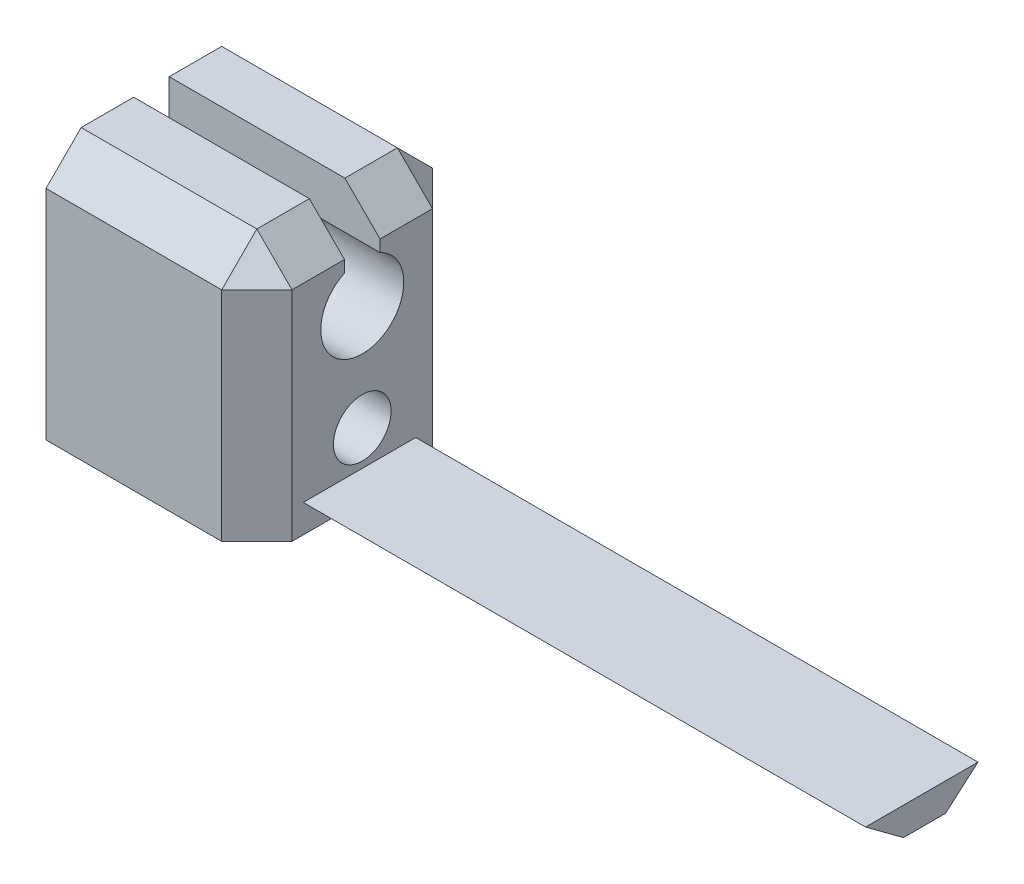
ISO-10303-21;
HEADER;
FILE_DESCRIPTION(('STEP AP214'),'2;1');
FILE_NAME('part.step','',(''),(''),'','','');
FILE_SCHEMA(('AUTOMOTIVE_DESIGN { 1 0 10303 214 1 1 1 1 }'));
ENDSEC;
DATA;
#1=APPLICATION_CONTEXT('core data for automotive mechanical design processes');
#2=APPLICATION_PROTOCOL_DEFINITION('international standard','automotive_design',2000,#1);
#3=PRODUCT_CONTEXT('',#1,'mechanical');
#4=PRODUCT('Part','Part','',(#3));
#5=PRODUCT_RELATED_PRODUCT_CATEGORY('part','',(#4));
#6=PRODUCT_DEFINITION_FORMATION('','',#4);
#7=PRODUCT_DEFINITION_CONTEXT('part definition',#1,'design');
#8=PRODUCT_DEFINITION('design','',#6,#7);
#9=PRODUCT_DEFINITION_SHAPE('','',#8);
#10=(LENGTH_UNIT() NAMED_UNIT(*) SI_UNIT(.MILLI.,.METRE.));
#11=(NAMED_UNIT(*) PLANE_ANGLE_UNIT() SI_UNIT($,.RADIAN.));
#12=(NAMED_UNIT(*) SI_UNIT($,.STERADIAN.) SOLID_ANGLE_UNIT());
#13=UNCERTAINTY_MEASURE_WITH_UNIT(LENGTH_MEASURE(1.E-05),#10,'distance_accuracy_value','');
#14=(GEOMETRIC_REPRESENTATION_CONTEXT(3) GLOBAL_UNCERTAINTY_ASSIGNED_CONTEXT((#13)) GLOBAL_UNIT_ASSIGNED_CONTEXT((#10,
#11,#12)) REPRESENTATION_CONTEXT('',''));
#15=CARTESIAN_POINT('',(0.,0.,0.));
#16=DIRECTION('',(0.,0.,1.));
#17=DIRECTION('',(1.,0.,0.));
#18=AXIS2_PLACEMENT_3D('',#15,#16,#17);
#19=CARTESIAN_POINT('',(0.,36.,0.));
#20=DIRECTION('',(0.,-1.,0.));
#21=DIRECTION('',(0.,0.,-1.));
#22=AXIS2_PLACEMENT_3D('',#19,#20,#21);
#23=PLANE('',#22);
#24=DIRECTION('',(1.,0.,0.));
#25=VECTOR('',#24,1.);
#26=CARTESIAN_POINT('',(0.,36.,10.));
#27=LINE('',#26,#25);
#28=CARTESIAN_POINT('',(-15.,36.,10.));
#29=VERTEX_POINT('',#28);
#30=CARTESIAN_POINT('',(10.,36.,10.));
#31=VERTEX_POINT('',#30);
#32=EDGE_CURVE('E91',#29,#31,#27,.T.);
#33=ORIENTED_EDGE('',*,*,#32,.T.);
#34=DIRECTION('',(0.,0.,-1.));
#35=VECTOR('',#34,1.);
#36=CARTESIAN_POINT('',(10.,36.,0.));
#37=LINE('',#36,#35);
#38=CARTESIAN_POINT('',(10.,36.,2.52855443460033));
#39=VERTEX_POINT('',#38);
#40=EDGE_CURVE('E83',#31,#39,#37,.T.);
#41=ORIENTED_EDGE('',*,*,#40,.T.);
#42=DIRECTION('',(1.,0.,0.));
#43=VECTOR('',#42,1.);
#44=CARTESIAN_POINT('',(0.,36.,2.52855443460033));
#45=LINE('',#44,#43);
#46=CARTESIAN_POINT('',(-15.,36.,2.52855443460033));
#47=VERTEX_POINT('',#46);
#48=EDGE_CURVE('E277',#47,#39,#45,.T.);
#49=ORIENTED_EDGE('',*,*,#48,.F.);
#50=DIRECTION('',(0.,0.,1.));
#51=VECTOR('',#50,1.);
#52=CARTESIAN_POINT('',(-15.,36.,15.));
#53=LINE('',#52,#51);
#54=EDGE_CURVE('E262',#47,#29,#53,.T.);
#55=ORIENTED_EDGE('',*,*,#54,.T.);
#56=EDGE_LOOP('',(#33,#41,#49,#55));
#57=FACE_BOUND('',#56,.T.);
#58=ADVANCED_FACE('F73',(#57),#23,.F.);
#59=CARTESIAN_POINT('',(15.,36.,15.));
#60=DIRECTION('',(-1.,0.,0.));
#61=DIRECTION('',(0.,0.,1.));
#62=AXIS2_PLACEMENT_3D('',#59,#60,#61);
#63=PLANE('',#62);
#64=CARTESIAN_POINT('',(15.,9.,0.));
#65=DIRECTION('',(1.,0.,0.));
#66=DIRECTION('',(0.,0.,-1.));
#67=AXIS2_PLACEMENT_3D('',#64,#65,#66);
#68=CIRCLE('',#67,4.1);
#69=CARTESIAN_POINT('',(15.,9.,-4.1));
#70=VERTEX_POINT('',#69);
#71=EDGE_CURVE('E220',#70,#70,#68,.T.);
#72=ORIENTED_EDGE('',*,*,#71,.F.);
#73=EDGE_LOOP('',(#72));
#74=FACE_BOUND('',#73,.T.);
#75=DIRECTION('',(0.,0.,-1.));
#76=VECTOR('',#75,1.);
#77=CARTESIAN_POINT('',(15.,0.,15.));
#78=LINE('',#77,#76);
#79=CARTESIAN_POINT('',(15.,0.,-2.99999999999999));
#80=VERTEX_POINT('',#79);
#81=CARTESIAN_POINT('',(15.,0.,-9.99999999999999));
#82=VERTEX_POINT('',#81);
#83=EDGE_CURVE('E258',#80,#82,#78,.T.);
#84=ORIENTED_EDGE('',*,*,#83,.T.);
#85=DIRECTION('',(0.,1.,0.));
#86=VECTOR('',#85,1.);
#87=CARTESIAN_POINT('',(15.,36.,-9.99999999999999));
#88=LINE('',#87,#86);
#89=CARTESIAN_POINT('',(15.,31.,-9.99999999999999));
#90=VERTEX_POINT('',#89);
#91=EDGE_CURVE('E301',#82,#90,#88,.T.);
#92=ORIENTED_EDGE('',*,*,#91,.T.);
#93=DIRECTION('',(0.,0.,1.));
#94=VECTOR('',#93,1.);
#95=CARTESIAN_POINT('',(15.,31.,15.));
#96=LINE('',#95,#94);
#97=CARTESIAN_POINT('',(15.,31.,-2.52855443460033));
#98=VERTEX_POINT('',#97);
#99=EDGE_CURVE('E299',#90,#98,#96,.T.);
#100=ORIENTED_EDGE('',*,*,#99,.T.);
#101=DIRECTION('',(0.,-1.,0.));
#102=VECTOR('',#101,1.);
#103=CARTESIAN_POINT('',(15.,36.,-2.52855443460033));
#104=LINE('',#103,#102);
#105=CARTESIAN_POINT('',(15.,29.3307046880561,-2.52855443460033));
#106=VERTEX_POINT('',#105);
#107=EDGE_CURVE('E219',#98,#106,#104,.T.);
#108=ORIENTED_EDGE('',*,*,#107,.T.);
#109=CARTESIAN_POINT('',(15.,24.,0.));
#110=DIRECTION('',(-1.,0.,0.));
#111=DIRECTION('',(0.,0.,1.));
#112=AXIS2_PLACEMENT_3D('',#109,#110,#111);
#113=CIRCLE('',#112,5.9);
#114=CARTESIAN_POINT('',(15.,29.3307046880561,2.52855443460033));
#115=VERTEX_POINT('',#114);
#116=EDGE_CURVE('E209',#115,#106,#113,.F.);
#117=ORIENTED_EDGE('',*,*,#116,.F.);
#118=DIRECTION('',(0.,-1.,0.));
#119=VECTOR('',#118,1.);
#120=CARTESIAN_POINT('',(15.,36.,2.52855443460033));
#121=LINE('',#120,#119);
#122=CARTESIAN_POINT('',(15.,31.,2.52855443460033));
#123=VERTEX_POINT('',#122);
#124=EDGE_CURVE('E193',#123,#115,#121,.T.);
#125=ORIENTED_EDGE('',*,*,#124,.F.);
#126=DIRECTION('',(0.,0.,1.));
#127=VECTOR('',#126,1.);
#128=CARTESIAN_POINT('',(15.,31.,15.));
#129=LINE('',#128,#127);
#130=CARTESIAN_POINT('',(15.,31.,10.));
#131=VERTEX_POINT('',#130);
#132=EDGE_CURVE('E294',#123,#131,#129,.T.);
#133=ORIENTED_EDGE('',*,*,#132,.T.);
#134=DIRECTION('',(0.,-1.,0.));
#135=VECTOR('',#134,1.);
#136=CARTESIAN_POINT('',(15.,36.,10.));
#137=LINE('',#136,#135);
#138=CARTESIAN_POINT('',(15.,0.,10.));
#139=VERTEX_POINT('',#138);
#140=EDGE_CURVE('E296',#131,#139,#137,.T.);
#141=ORIENTED_EDGE('',*,*,#140,.T.);
#142=CARTESIAN_POINT('',(15.,0.,3.00000000000001));
#143=VERTEX_POINT('',#142);
#144=EDGE_CURVE('E263',#139,#143,#78,.T.);
#145=ORIENTED_EDGE('',*,*,#144,.T.);
#146=DIRECTION('',(0.,0.595766049477653,0.803158025727062));
#147=VECTOR('',#146,1.);
#148=CARTESIAN_POINT('',(15.,-1.43548285228105,1.06481155713063));
#149=LINE('',#148,#147);
#150=CARTESIAN_POINT('',(15.,4.,8.39243903831877));
#151=VERTEX_POINT('',#150);
#152=EDGE_CURVE('E232',#143,#151,#149,.T.);
#153=ORIENTED_EDGE('',*,*,#152,.T.);
#154=DIRECTION('',(0.,0.,-1.));
#155=VECTOR('',#154,1.);
#156=CARTESIAN_POINT('',(15.,4.,0.));
#157=LINE('',#156,#155);
#158=CARTESIAN_POINT('',(15.,4.,-7.60756096168123));
#159=VERTEX_POINT('',#158);
#160=EDGE_CURVE('E244',#151,#159,#157,.T.);
#161=ORIENTED_EDGE('',*,*,#160,.T.);
#162=DIRECTION('',(0.,0.65556491281918,-0.755138825038404));
#163=VECTOR('',#162,1.);
#164=CARTESIAN_POINT('',(15.,-1.48512755400804,-1.28929606475886));
#165=LINE('',#164,#163);
#166=EDGE_CURVE('E241',#80,#159,#165,.T.);
#167=ORIENTED_EDGE('',*,*,#166,.F.);
#168=EDGE_LOOP('',(#84,#92,#100,#108,#117,#125,#133,#141,#145,#153,#161,#167));
#169=FACE_BOUND('',#168,.T.);
#170=ADVANCED_FACE('F217',(#74,#169),#63,.F.);
#171=CARTESIAN_POINT('',(-15.,36.,-15.));
#172=DIRECTION('',(0.,0.,1.));
#173=DIRECTION('',(1.,0.,0.));
#174=AXIS2_PLACEMENT_3D('',#171,#172,#173);
#175=PLANE('',#174);
#176=DIRECTION('',(1.,0.,0.));
#177=VECTOR('',#176,1.);
#178=CARTESIAN_POINT('',(-15.,31.,-15.));
#179=LINE('',#178,#177);
#180=CARTESIAN_POINT('',(-15.,31.,-15.));
#181=VERTEX_POINT('',#180);
#182=CARTESIAN_POINT('',(9.99999999999997,31.,-15.));
#183=VERTEX_POINT('',#182);
#184=EDGE_CURVE('E285',#181,#183,#179,.T.);
#185=ORIENTED_EDGE('',*,*,#184,.T.);
#186=DIRECTION('',(0.,-1.,0.));
#187=VECTOR('',#186,1.);
#188=CARTESIAN_POINT('',(9.99999999999997,36.,-15.));
#189=LINE('',#188,#187);
#190=CARTESIAN_POINT('',(9.99999999999997,0.,-15.));
#191=VERTEX_POINT('',#190);
#192=EDGE_CURVE('E287',#183,#191,#189,.T.);
#193=ORIENTED_EDGE('',*,*,#192,.T.);
#194=DIRECTION('',(-1.,0.,0.));
#195=VECTOR('',#194,1.);
#196=CARTESIAN_POINT('',(-15.,0.,-15.));
#197=LINE('',#196,#195);
#198=CARTESIAN_POINT('',(-15.,0.,-15.));
#199=VERTEX_POINT('',#198);
#200=EDGE_CURVE('E265',#191,#199,#197,.T.);
#201=ORIENTED_EDGE('',*,*,#200,.T.);
#202=DIRECTION('',(0.,-1.,0.));
#203=VECTOR('',#202,1.);
#204=CARTESIAN_POINT('',(-15.,36.,-15.));
#205=LINE('',#204,#203);
#206=EDGE_CURVE('E275',#181,#199,#205,.T.);
#207=ORIENTED_EDGE('',*,*,#206,.F.);
#208=EDGE_LOOP('',(#185,#193,#201,#207));
#209=FACE_BOUND('',#208,.T.);
#210=ADVANCED_FACE('F394',(#209),#175,.F.);
#211=CARTESIAN_POINT('',(-15.,36.,15.));
#212=DIRECTION('',(1.,0.,0.));
#213=DIRECTION('',(0.,0.,-1.));
#214=AXIS2_PLACEMENT_3D('',#211,#212,#213);
#215=PLANE('',#214);
#216=CARTESIAN_POINT('',(-15.,9.,0.));
#217=DIRECTION('',(1.,0.,0.));
#218=DIRECTION('',(0.,0.,-1.));
#219=AXIS2_PLACEMENT_3D('',#216,#217,#218);
#220=CIRCLE('',#219,4.1);
#221=CARTESIAN_POINT('',(-15.,9.,-4.1));
#222=VERTEX_POINT('',#221);
#223=EDGE_CURVE('E223',#222,#222,#220,.T.);
#224=ORIENTED_EDGE('',*,*,#223,.T.);
#225=EDGE_LOOP('',(#224));
#226=FACE_BOUND('',#225,.T.);
#227=CARTESIAN_POINT('',(-15.,36.,-9.99999999999999));
#228=VERTEX_POINT('',#227);
#229=CARTESIAN_POINT('',(-15.,36.,-2.52855443460033));
#230=VERTEX_POINT('',#229);
#231=EDGE_CURVE('E259',#228,#230,#53,.T.);
#232=ORIENTED_EDGE('',*,*,#231,.F.);
#233=DIRECTION('',(0.,0.707106781186549,0.707106781186546));
#234=VECTOR('',#233,1.);
#235=CARTESIAN_POINT('',(-15.,36.,-9.99999999999999));
#236=LINE('',#235,#234);
#237=EDGE_CURVE('E311',#228,#181,#236,.F.);
#238=ORIENTED_EDGE('',*,*,#237,.T.);
#239=ORIENTED_EDGE('',*,*,#206,.T.);
#240=DIRECTION('',(0.,0.,1.));
#241=VECTOR('',#240,1.);
#242=CARTESIAN_POINT('',(-15.,0.,15.));
#243=LINE('',#242,#241);
#244=CARTESIAN_POINT('',(-15.,0.,15.));
#245=VERTEX_POINT('',#244);
#246=EDGE_CURVE('E268',#199,#245,#243,.T.);
#247=ORIENTED_EDGE('',*,*,#246,.T.);
#248=DIRECTION('',(0.,-1.,0.));
#249=VECTOR('',#248,1.);
#250=CARTESIAN_POINT('',(-15.,36.,15.));
#251=LINE('',#250,#249);
#252=CARTESIAN_POINT('',(-15.,31.,15.));
#253=VERTEX_POINT('',#252);
#254=EDGE_CURVE('E261',#253,#245,#251,.T.);
#255=ORIENTED_EDGE('',*,*,#254,.F.);
#256=DIRECTION('',(0.,-0.70710678118655,0.707106781186546));
#257=VECTOR('',#256,1.);
#258=CARTESIAN_POINT('',(-15.,36.,10.));
#259=LINE('',#258,#257);
#260=EDGE_CURVE('E309',#253,#29,#259,.F.);
#261=ORIENTED_EDGE('',*,*,#260,.T.);
#262=ORIENTED_EDGE('',*,*,#54,.F.);
#263=DIRECTION('',(0.,1.,0.));
#264=VECTOR('',#263,1.);
#265=CARTESIAN_POINT('',(-15.,36.,2.52855443460033));
#266=LINE('',#265,#264);
#267=CARTESIAN_POINT('',(-15.,29.3307046880561,2.52855443460033));
#268=VERTEX_POINT('',#267);
#269=EDGE_CURVE('E203',#268,#47,#266,.T.);
#270=ORIENTED_EDGE('',*,*,#269,.F.);
#271=CARTESIAN_POINT('',(-15.,24.,0.));
#272=DIRECTION('',(1.,0.,0.));
#273=DIRECTION('',(0.,0.,-1.));
#274=AXIS2_PLACEMENT_3D('',#271,#272,#273);
#275=CIRCLE('',#274,5.9);
#276=CARTESIAN_POINT('',(-15.,29.3307046880561,-2.52855443460033));
#277=VERTEX_POINT('',#276);
#278=EDGE_CURVE('E212',#277,#268,#275,.F.);
#279=ORIENTED_EDGE('',*,*,#278,.F.);
#280=DIRECTION('',(0.,1.,0.));
#281=VECTOR('',#280,1.);
#282=CARTESIAN_POINT('',(-15.,36.,-2.52855443460033));
#283=LINE('',#282,#281);
#284=EDGE_CURVE('E202',#277,#230,#283,.T.);
#285=ORIENTED_EDGE('',*,*,#284,.T.);
#286=EDGE_LOOP('',(#232,#238,#239,#247,#255,#261,#262,#270,#279,#285));
#287=FACE_BOUND('',#286,.T.);
#288=ADVANCED_FACE('F384',(#226,#287),#215,.F.);
#289=CARTESIAN_POINT('',(-15.,36.,15.));
#290=DIRECTION('',(0.,0.,-1.));
#291=DIRECTION('',(-1.,0.,0.));
#292=AXIS2_PLACEMENT_3D('',#289,#290,#291);
#293=PLANE('',#292);
#294=DIRECTION('',(1.,0.,0.));
#295=VECTOR('',#294,1.);
#296=CARTESIAN_POINT('',(-15.,0.,15.));
#297=LINE('',#296,#295);
#298=CARTESIAN_POINT('',(9.99999999999999,0.,15.));
#299=VERTEX_POINT('',#298);
#300=EDGE_CURVE('E271',#245,#299,#297,.T.);
#301=ORIENTED_EDGE('',*,*,#300,.T.);
#302=DIRECTION('',(0.,1.,0.));
#303=VECTOR('',#302,1.);
#304=CARTESIAN_POINT('',(9.99999999999999,36.,15.));
#305=LINE('',#304,#303);
#306=CARTESIAN_POINT('',(9.99999999999999,31.,15.));
#307=VERTEX_POINT('',#306);
#308=EDGE_CURVE('E315',#299,#307,#305,.T.);
#309=ORIENTED_EDGE('',*,*,#308,.T.);
#310=DIRECTION('',(-1.,0.,0.));
#311=VECTOR('',#310,1.);
#312=CARTESIAN_POINT('',(-15.,31.,15.));
#313=LINE('',#312,#311);
#314=EDGE_CURVE('E313',#307,#253,#313,.T.);
#315=ORIENTED_EDGE('',*,*,#314,.T.);
#316=ORIENTED_EDGE('',*,*,#254,.T.);
#317=EDGE_LOOP('',(#301,#309,#315,#316));
#318=FACE_BOUND('',#317,.T.);
#319=ADVANCED_FACE('F391',(#318),#293,.F.);
#320=DIRECTION('',(1.,0.,0.));
#321=VECTOR('',#320,1.);
#322=CARTESIAN_POINT('',(0.,36.,-2.52855443460033));
#323=LINE('',#322,#321);
#324=CARTESIAN_POINT('',(10.,36.,-2.52855443460033));
#325=VERTEX_POINT('',#324);
#326=EDGE_CURVE('E281',#230,#325,#323,.T.);
#327=ORIENTED_EDGE('',*,*,#326,.T.);
#328=DIRECTION('',(0.,0.,-1.));
#329=VECTOR('',#328,1.);
#330=CARTESIAN_POINT('',(10.,36.,0.));
#331=LINE('',#330,#329);
#332=CARTESIAN_POINT('',(10.,36.,-9.99999999999999));
#333=VERTEX_POINT('',#332);
#334=EDGE_CURVE('E305',#325,#333,#331,.T.);
#335=ORIENTED_EDGE('',*,*,#334,.T.);
#336=DIRECTION('',(-1.,0.,0.));
#337=VECTOR('',#336,1.);
#338=CARTESIAN_POINT('',(0.,36.,-9.99999999999999));
#339=LINE('',#338,#337);
#340=EDGE_CURVE('E303',#333,#228,#339,.T.);
#341=ORIENTED_EDGE('',*,*,#340,.T.);
#342=ORIENTED_EDGE('',*,*,#231,.T.);
#343=EDGE_LOOP('',(#327,#335,#341,#342));
#344=FACE_BOUND('',#343,.T.);
#345=ADVANCED_FACE('F400',(#344),#23,.F.);
#346=CARTESIAN_POINT('',(0.,0.,0.));
#347=DIRECTION('',(0.,-1.,0.));
#348=DIRECTION('',(0.,0.,-1.));
#349=AXIS2_PLACEMENT_3D('',#346,#347,#348);
#350=PLANE('',#349);
#351=ORIENTED_EDGE('',*,*,#200,.F.);
#352=DIRECTION('',(-0.707106781186549,0.,-0.707106781186546));
#353=VECTOR('',#352,1.);
#354=CARTESIAN_POINT('',(12.5,0.,-12.5));
#355=LINE('',#354,#353);
#356=EDGE_CURVE('E292',#191,#82,#355,.F.);
#357=ORIENTED_EDGE('',*,*,#356,.T.);
#358=ORIENTED_EDGE('',*,*,#83,.F.);
#359=DIRECTION('',(-1.,0.,0.));
#360=VECTOR('',#359,1.);
#361=CARTESIAN_POINT('',(95.,0.,-3.));
#362=LINE('',#361,#360);
#363=CARTESIAN_POINT('',(95.,0.,-3.));
#364=VERTEX_POINT('',#363);
#365=EDGE_CURVE('E255',#364,#80,#362,.T.);
#366=ORIENTED_EDGE('',*,*,#365,.F.);
#367=DIRECTION('',(0.,0.,-1.));
#368=VECTOR('',#367,1.);
#369=CARTESIAN_POINT('',(95.,0.,0.));
#370=LINE('',#369,#368);
#371=CARTESIAN_POINT('',(95.,0.,3.));
#372=VERTEX_POINT('',#371);
#373=EDGE_CURVE('E228',#372,#364,#370,.T.);
#374=ORIENTED_EDGE('',*,*,#373,.F.);
#375=DIRECTION('',(-1.,0.,0.));
#376=VECTOR('',#375,1.);
#377=CARTESIAN_POINT('',(95.,0.,3.));
#378=LINE('',#377,#376);
#379=EDGE_CURVE('E240',#372,#143,#378,.T.);
#380=ORIENTED_EDGE('',*,*,#379,.T.);
#381=ORIENTED_EDGE('',*,*,#144,.F.);
#382=DIRECTION('',(0.70710678118655,0.,-0.707106781186546));
#383=VECTOR('',#382,1.);
#384=CARTESIAN_POINT('',(12.5,0.,12.5));
#385=LINE('',#384,#383);
#386=EDGE_CURVE('E290',#139,#299,#385,.F.);
#387=ORIENTED_EDGE('',*,*,#386,.T.);
#388=ORIENTED_EDGE('',*,*,#300,.F.);
#389=ORIENTED_EDGE('',*,*,#246,.F.);
#390=EDGE_LOOP('',(#351,#357,#358,#366,#374,#380,#381,#387,#388,#389));
#391=FACE_BOUND('',#390,.T.);
#392=ADVANCED_FACE('F346',(#391),#350,.T.);
#393=CARTESIAN_POINT('',(95.,-1.48512755400804,-1.28929606475886));
#394=DIRECTION('',(0.,0.755138825038404,0.65556491281918));
#395=DIRECTION('',(0.,-0.65556491281918,0.755138825038404));
#396=AXIS2_PLACEMENT_3D('',#393,#394,#395);
#397=PLANE('',#396);
#398=ORIENTED_EDGE('',*,*,#166,.T.);
#399=DIRECTION('',(-1.,0.,0.));
#400=VECTOR('',#399,1.);
#401=CARTESIAN_POINT('',(95.,4.,-7.60756096168123));
#402=LINE('',#401,#400);
#403=CARTESIAN_POINT('',(95.,4.,-7.60756096168123));
#404=VERTEX_POINT('',#403);
#405=EDGE_CURVE('E252',#404,#159,#402,.T.);
#406=ORIENTED_EDGE('',*,*,#405,.F.);
#407=DIRECTION('',(0.,0.65556491281918,-0.755138825038404));
#408=VECTOR('',#407,1.);
#409=CARTESIAN_POINT('',(95.,-1.48512755400804,-1.28929606475886));
#410=LINE('',#409,#408);
#411=EDGE_CURVE('E231',#364,#404,#410,.T.);
#412=ORIENTED_EDGE('',*,*,#411,.F.);
#413=ORIENTED_EDGE('',*,*,#365,.T.);
#414=EDGE_LOOP('',(#398,#406,#412,#413));
#415=FACE_BOUND('',#414,.T.);
#416=ADVANCED_FACE('F361',(#415),#397,.F.);
#417=CARTESIAN_POINT('',(95.,4.,0.));
#418=DIRECTION('',(0.,1.,0.));
#419=DIRECTION('',(0.,0.,1.));
#420=AXIS2_PLACEMENT_3D('',#417,#418,#419);
#421=PLANE('',#420);
#422=ORIENTED_EDGE('',*,*,#160,.F.);
#423=DIRECTION('',(-1.,0.,0.));
#424=VECTOR('',#423,1.);
#425=CARTESIAN_POINT('',(95.,4.,8.39243903831877));
#426=LINE('',#425,#424);
#427=CARTESIAN_POINT('',(95.,4.,8.39243903831877));
#428=VERTEX_POINT('',#427);
#429=EDGE_CURVE('E249',#428,#151,#426,.T.);
#430=ORIENTED_EDGE('',*,*,#429,.F.);
#431=DIRECTION('',(0.,0.,-1.));
#432=VECTOR('',#431,1.);
#433=CARTESIAN_POINT('',(95.,4.,0.));
#434=LINE('',#433,#432);
#435=EDGE_CURVE('E234',#428,#404,#434,.T.);
#436=ORIENTED_EDGE('',*,*,#435,.T.);
#437=ORIENTED_EDGE('',*,*,#405,.T.);
#438=EDGE_LOOP('',(#422,#430,#436,#437));
#439=FACE_BOUND('',#438,.T.);
#440=ADVANCED_FACE('F358',(#439),#421,.T.);
#441=CARTESIAN_POINT('',(95.,-1.43548285228105,1.06481155713063));
#442=DIRECTION('',(0.,-0.803158025727061,0.595766049477653));
#443=DIRECTION('',(0.,-0.595766049477653,-0.803158025727061));
#444=AXIS2_PLACEMENT_3D('',#441,#442,#443);
#445=PLANE('',#444);
#446=ORIENTED_EDGE('',*,*,#152,.F.);
#447=ORIENTED_EDGE('',*,*,#379,.F.);
#448=DIRECTION('',(0.,0.595766049477653,0.803158025727062));
#449=VECTOR('',#448,1.);
#450=CARTESIAN_POINT('',(95.,-1.43548285228105,1.06481155713063));
#451=LINE('',#450,#449);
#452=EDGE_CURVE('E237',#372,#428,#451,.T.);
#453=ORIENTED_EDGE('',*,*,#452,.T.);
#454=ORIENTED_EDGE('',*,*,#429,.T.);
#455=EDGE_LOOP('',(#446,#447,#453,#454));
#456=FACE_BOUND('',#455,.T.);
#457=ADVANCED_FACE('F353',(#456),#445,.T.);
#458=CARTESIAN_POINT('',(95.,0.,0.));
#459=DIRECTION('',(1.,0.,0.));
#460=DIRECTION('',(0.,0.,-1.));
#461=AXIS2_PLACEMENT_3D('',#458,#459,#460);
#462=PLANE('',#461);
#463=ORIENTED_EDGE('',*,*,#373,.T.);
#464=ORIENTED_EDGE('',*,*,#411,.T.);
#465=ORIENTED_EDGE('',*,*,#435,.F.);
#466=ORIENTED_EDGE('',*,*,#452,.F.);
#467=EDGE_LOOP('',(#463,#464,#465,#466));
#468=FACE_BOUND('',#467,.T.);
#469=ADVANCED_FACE('F531',(#468),#462,.T.);
#470=CARTESIAN_POINT('',(-65.,9.,0.));
#471=DIRECTION('',(1.,0.,0.));
#472=DIRECTION('',(0.,0.,-1.));
#473=AXIS2_PLACEMENT_3D('',#470,#471,#472);
#474=CYLINDRICAL_SURFACE('',#473,4.1);
#475=ORIENTED_EDGE('',*,*,#71,.T.);
#476=EDGE_LOOP('',(#475));
#477=FACE_BOUND('',#476,.T.);
#478=ORIENTED_EDGE('',*,*,#223,.F.);
#479=EDGE_LOOP('',(#478));
#480=FACE_BOUND('',#479,.T.);
#481=ADVANCED_FACE('F540',(#477,#480),#474,.F.);
#482=CARTESIAN_POINT('',(95.,24.,0.));
#483=DIRECTION('',(-1.,0.,0.));
#484=DIRECTION('',(0.,0.,1.));
#485=AXIS2_PLACEMENT_3D('',#482,#483,#484);
#486=CYLINDRICAL_SURFACE('',#485,5.9);
#487=ORIENTED_EDGE('',*,*,#116,.T.);
#488=DIRECTION('',(-1.,0.,0.));
#489=VECTOR('',#488,1.);
#490=CARTESIAN_POINT('',(95.,29.3307046880561,-2.52855443460033));
#491=LINE('',#490,#489);
#492=EDGE_CURVE('E213',#106,#277,#491,.T.);
#493=ORIENTED_EDGE('',*,*,#492,.T.);
#494=ORIENTED_EDGE('',*,*,#278,.T.);
#495=DIRECTION('',(-1.,0.,0.));
#496=VECTOR('',#495,1.);
#497=CARTESIAN_POINT('',(95.,29.3307046880561,2.52855443460033));
#498=LINE('',#497,#496);
#499=EDGE_CURVE('E196',#115,#268,#498,.T.);
#500=ORIENTED_EDGE('',*,*,#499,.F.);
#501=EDGE_LOOP('',(#487,#493,#494,#500));
#502=FACE_BOUND('',#501,.T.);
#503=ADVANCED_FACE('F207',(#502),#486,.F.);
#504=CARTESIAN_POINT('',(95.,0.,-2.52855443460033));
#505=DIRECTION('',(0.,0.,-1.));
#506=DIRECTION('',(-1.,0.,0.));
#507=AXIS2_PLACEMENT_3D('',#504,#505,#506);
#508=PLANE('',#507);
#509=ORIENTED_EDGE('',*,*,#107,.F.);
#510=DIRECTION('',(0.707106781186546,-0.707106781186549,0.));
#511=VECTOR('',#510,1.);
#512=CARTESIAN_POINT('',(10.,36.,-2.52855443460033));
#513=LINE('',#512,#511);
#514=EDGE_CURVE('E307',#98,#325,#513,.F.);
#515=ORIENTED_EDGE('',*,*,#514,.T.);
#516=ORIENTED_EDGE('',*,*,#326,.F.);
#517=ORIENTED_EDGE('',*,*,#284,.F.);
#518=ORIENTED_EDGE('',*,*,#492,.F.);
#519=EDGE_LOOP('',(#509,#515,#516,#517,#518));
#520=FACE_BOUND('',#519,.T.);
#521=ADVANCED_FACE('F377',(#520),#508,.F.);
#522=CARTESIAN_POINT('',(95.,0.,2.52855443460033));
#523=DIRECTION('',(0.,0.,-1.));
#524=DIRECTION('',(-1.,0.,0.));
#525=AXIS2_PLACEMENT_3D('',#522,#523,#524);
#526=PLANE('',#525);
#527=ORIENTED_EDGE('',*,*,#48,.T.);
#528=DIRECTION('',(-0.707106781186546,0.70710678118655,0.));
#529=VECTOR('',#528,1.);
#530=CARTESIAN_POINT('',(70.4999999999998,-24.5000000000001,2.52855443460033));
#531=LINE('',#530,#529);
#532=EDGE_CURVE('E12',#39,#123,#531,.F.);
#533=ORIENTED_EDGE('',*,*,#532,.T.);
#534=ORIENTED_EDGE('',*,*,#124,.T.);
#535=ORIENTED_EDGE('',*,*,#499,.T.);
#536=ORIENTED_EDGE('',*,*,#269,.T.);
#537=EDGE_LOOP('',(#527,#533,#534,#535,#536));
#538=FACE_BOUND('',#537,.T.);
#539=ADVANCED_FACE('F195',(#538),#526,.T.);
#540=CARTESIAN_POINT('',(10.,36.,0.));
#541=DIRECTION('',(-0.707106781186549,-0.707106781186545,0.));
#542=DIRECTION('',(0.,0.,-1.));
#543=AXIS2_PLACEMENT_3D('',#540,#541,#542);
#544=PLANE('',#543);
#545=ORIENTED_EDGE('',*,*,#514,.F.);
#546=ORIENTED_EDGE('',*,*,#99,.F.);
#547=DIRECTION('',(-0.707106781186546,0.707106781186549,0.));
#548=VECTOR('',#547,1.);
#549=CARTESIAN_POINT('',(15.,31.,-9.99999999999999));
#550=LINE('',#549,#548);
#551=EDGE_CURVE('E214',#333,#90,#550,.F.);
#552=ORIENTED_EDGE('',*,*,#551,.F.);
#553=ORIENTED_EDGE('',*,*,#334,.F.);
#554=EDGE_LOOP('',(#545,#546,#552,#553));
#555=FACE_BOUND('',#554,.T.);
#556=ADVANCED_FACE('F375',(#555),#544,.F.);
#557=CARTESIAN_POINT('',(0.,36.,-9.99999999999999));
#558=DIRECTION('',(0.,-0.707106781186545,0.707106781186549));
#559=DIRECTION('',(-1.,0.,0.));
#560=AXIS2_PLACEMENT_3D('',#557,#558,#559);
#561=PLANE('',#560);
#562=ORIENTED_EDGE('',*,*,#237,.F.);
#563=ORIENTED_EDGE('',*,*,#340,.F.);
#564=DIRECTION('',(0.,-0.707106781186549,-0.707106781186546));
#565=VECTOR('',#564,1.);
#566=CARTESIAN_POINT('',(9.99999999999999,33.5,-12.5));
#567=LINE('',#566,#565);
#568=EDGE_CURVE('E322',#183,#333,#567,.F.);
#569=ORIENTED_EDGE('',*,*,#568,.F.);
#570=ORIENTED_EDGE('',*,*,#184,.F.);
#571=EDGE_LOOP('',(#562,#563,#569,#570));
#572=FACE_BOUND('',#571,.T.);
#573=ADVANCED_FACE('F398',(#572),#561,.F.);
#574=CARTESIAN_POINT('',(15.,31.,-9.99999999999999));
#575=DIRECTION('',(0.577350269189626,0.577350269189623,-0.577350269189629));
#576=DIRECTION('',(-0.707106781186549,0.,-0.707106781186545));
#577=AXIS2_PLACEMENT_3D('',#574,#575,#576);
#578=PLANE('',#577);
#579=ORIENTED_EDGE('',*,*,#568,.T.);
#580=ORIENTED_EDGE('',*,*,#551,.T.);
#581=DIRECTION('',(0.707106781186549,0.,0.707106781186546));
#582=VECTOR('',#581,1.);
#583=CARTESIAN_POINT('',(15.,31.,-9.99999999999999));
#584=LINE('',#583,#582);
#585=EDGE_CURVE('E319',#183,#90,#584,.T.);
#586=ORIENTED_EDGE('',*,*,#585,.F.);
#587=EDGE_LOOP('',(#579,#580,#586));
#588=FACE_BOUND('',#587,.T.);
#589=ADVANCED_FACE('F369',(#588),#578,.T.);
#590=CARTESIAN_POINT('',(9.99999999999997,36.,-15.));
#591=DIRECTION('',(-0.707106781186545,0.,0.707106781186549));
#592=DIRECTION('',(0.,-1.,0.));
#593=AXIS2_PLACEMENT_3D('',#590,#591,#592);
#594=PLANE('',#593);
#595=ORIENTED_EDGE('',*,*,#585,.T.);
#596=ORIENTED_EDGE('',*,*,#91,.F.);
#597=ORIENTED_EDGE('',*,*,#356,.F.);
#598=ORIENTED_EDGE('',*,*,#192,.F.);
#599=EDGE_LOOP('',(#595,#596,#597,#598));
#600=FACE_BOUND('',#599,.T.);
#601=ADVANCED_FACE('F365',(#600),#594,.F.);
#602=CARTESIAN_POINT('',(0.,36.,10.));
#603=DIRECTION('',(0.,-0.707106781186545,-0.707106781186549));
#604=DIRECTION('',(1.,0.,0.));
#605=AXIS2_PLACEMENT_3D('',#602,#603,#604);
#606=PLANE('',#605);
#607=ORIENTED_EDGE('',*,*,#260,.F.);
#608=ORIENTED_EDGE('',*,*,#314,.F.);
#609=DIRECTION('',(0.,0.707106781186549,-0.707106781186545));
#610=VECTOR('',#609,1.);
#611=CARTESIAN_POINT('',(9.99999999999999,31.,15.));
#612=LINE('',#611,#610);
#613=EDGE_CURVE('E78',#31,#307,#612,.F.);
#614=ORIENTED_EDGE('',*,*,#613,.F.);
#615=ORIENTED_EDGE('',*,*,#32,.F.);
#616=EDGE_LOOP('',(#607,#608,#614,#615));
#617=FACE_BOUND('',#616,.T.);
#618=ADVANCED_FACE('F76',(#617),#606,.F.);
#619=CARTESIAN_POINT('',(10.,36.,0.));
#620=DIRECTION('',(-0.707106781186549,-0.707106781186545,0.));
#621=DIRECTION('',(0.,0.,-1.));
#622=AXIS2_PLACEMENT_3D('',#619,#620,#621);
#623=PLANE('',#622);
#624=ORIENTED_EDGE('',*,*,#532,.F.);
#625=ORIENTED_EDGE('',*,*,#40,.F.);
#626=DIRECTION('',(0.707106781186546,-0.70710678118655,0.));
#627=VECTOR('',#626,1.);
#628=CARTESIAN_POINT('',(12.5,33.5,10.));
#629=LINE('',#628,#627);
#630=EDGE_CURVE('E329',#131,#31,#629,.F.);
#631=ORIENTED_EDGE('',*,*,#630,.F.);
#632=ORIENTED_EDGE('',*,*,#132,.F.);
#633=EDGE_LOOP('',(#624,#625,#631,#632));
#634=FACE_BOUND('',#633,.T.);
#635=ADVANCED_FACE('F454',(#634),#623,.F.);
#636=CARTESIAN_POINT('',(9.99999999999999,31.,15.));
#637=DIRECTION('',(0.577350269189626,0.577350269189623,0.577350269189629));
#638=DIRECTION('',(0.707106781186549,0.,-0.707106781186545));
#639=AXIS2_PLACEMENT_3D('',#636,#637,#638);
#640=PLANE('',#639);
#641=ORIENTED_EDGE('',*,*,#630,.T.);
#642=ORIENTED_EDGE('',*,*,#613,.T.);
#643=DIRECTION('',(-0.70710678118655,0.,0.707106781186546));
#644=VECTOR('',#643,1.);
#645=CARTESIAN_POINT('',(9.99999999999999,31.,15.));
#646=LINE('',#645,#644);
#647=EDGE_CURVE('E327',#131,#307,#646,.T.);
#648=ORIENTED_EDGE('',*,*,#647,.F.);
#649=EDGE_LOOP('',(#641,#642,#648));
#650=FACE_BOUND('',#649,.T.);
#651=ADVANCED_FACE('F336',(#650),#640,.T.);
#652=CARTESIAN_POINT('',(15.,36.,10.));
#653=DIRECTION('',(-0.707106781186545,0.,-0.707106781186549));
#654=DIRECTION('',(0.,-1.,0.));
#655=AXIS2_PLACEMENT_3D('',#652,#653,#654);
#656=PLANE('',#655);
#657=ORIENTED_EDGE('',*,*,#647,.T.);
#658=ORIENTED_EDGE('',*,*,#308,.F.);
#659=ORIENTED_EDGE('',*,*,#386,.F.);
#660=ORIENTED_EDGE('',*,*,#140,.F.);
#661=EDGE_LOOP('',(#657,#658,#659,#660));
#662=FACE_BOUND('',#661,.T.);
#663=ADVANCED_FACE('F342',(#662),#656,.F.);
#664=CLOSED_SHELL('',(#58,#170,#210,#288,#319,#345,#392,#416,#440,#457,#469,#481,#503,#521,#539,
#556,#573,#589,#601,#618,#635,#651,#663));
#665=MANIFOLD_SOLID_BREP('B2',#664);
#666=ADVANCED_BREP_SHAPE_REPRESENTATION('',(#18,#665),#14);
#667=SHAPE_DEFINITION_REPRESENTATION(#9,#666);
ENDSEC;
END-ISO-10303-21;
